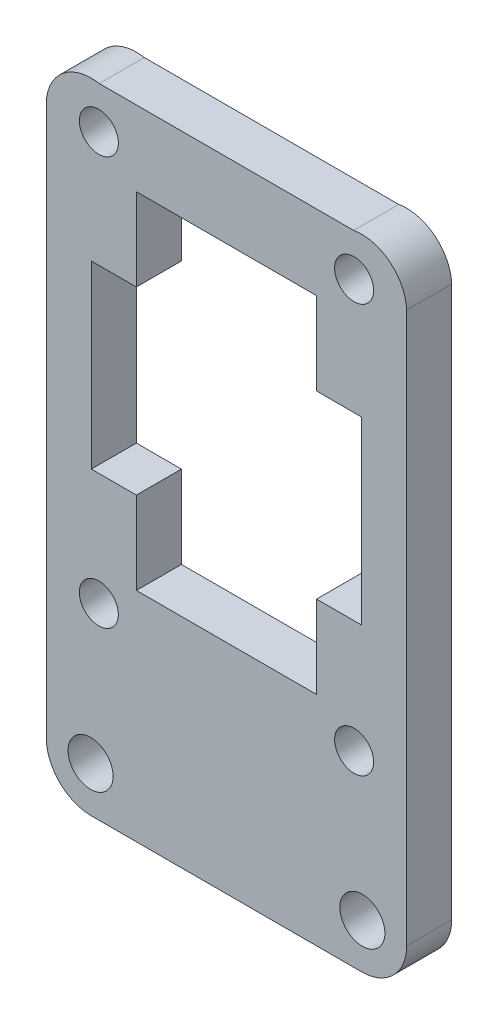
ISO-10303-21;
HEADER;
FILE_DESCRIPTION(('STEP AP214'),'2;1');
FILE_NAME('part.step','',(''),(''),'','','');
FILE_SCHEMA(('AUTOMOTIVE_DESIGN { 1 0 10303 214 1 1 1 1 }'));
ENDSEC;
DATA;
#1=APPLICATION_CONTEXT('core data for automotive mechanical design processes');
#2=APPLICATION_PROTOCOL_DEFINITION('international standard','automotive_design',2000,#1);
#3=PRODUCT_CONTEXT('',#1,'mechanical');
#4=PRODUCT('Part','Part','',(#3));
#5=PRODUCT_RELATED_PRODUCT_CATEGORY('part','',(#4));
#6=PRODUCT_DEFINITION_FORMATION('','',#4);
#7=PRODUCT_DEFINITION_CONTEXT('part definition',#1,'design');
#8=PRODUCT_DEFINITION('design','',#6,#7);
#9=PRODUCT_DEFINITION_SHAPE('','',#8);
#10=(LENGTH_UNIT() NAMED_UNIT(*) SI_UNIT(.MILLI.,.METRE.));
#11=(NAMED_UNIT(*) PLANE_ANGLE_UNIT() SI_UNIT($,.RADIAN.));
#12=(NAMED_UNIT(*) SI_UNIT($,.STERADIAN.) SOLID_ANGLE_UNIT());
#13=UNCERTAINTY_MEASURE_WITH_UNIT(LENGTH_MEASURE(1.E-05),#10,'distance_accuracy_value','');
#14=(GEOMETRIC_REPRESENTATION_CONTEXT(3) GLOBAL_UNCERTAINTY_ASSIGNED_CONTEXT((#13)) GLOBAL_UNIT_ASSIGNED_CONTEXT((#10,
#11,#12)) REPRESENTATION_CONTEXT('',''));
#15=CARTESIAN_POINT('',(0.,0.,0.));
#16=DIRECTION('',(0.,0.,1.));
#17=DIRECTION('',(1.,0.,0.));
#18=AXIS2_PLACEMENT_3D('',#15,#16,#17);
#19=CARTESIAN_POINT('',(72.2662,0.,3.));
#20=DIRECTION('',(-1.,0.,0.));
#21=DIRECTION('',(0.,0.,1.));
#22=AXIS2_PLACEMENT_3D('',#19,#20,#21);
#23=PLANE('',#22);
#24=DIRECTION('',(0.,1.,0.));
#25=VECTOR('',#24,1.);
#26=CARTESIAN_POINT('',(72.2662,0.,0.));
#27=LINE('',#26,#25);
#28=CARTESIAN_POINT('',(72.2662,19.7499999999624,0.));
#29=VERTEX_POINT('',#28);
#30=CARTESIAN_POINT('',(72.2662,56.4210437109096,0.));
#31=VERTEX_POINT('',#30);
#32=EDGE_CURVE('E262',#29,#31,#27,.T.);
#33=ORIENTED_EDGE('',*,*,#32,.T.);
#34=DIRECTION('',(0.,0.,-1.));
#35=VECTOR('',#34,1.);
#36=CARTESIAN_POINT('',(72.2662,56.4210437109096,3.));
#37=LINE('',#36,#35);
#38=CARTESIAN_POINT('',(72.2662,56.4210437109096,3.));
#39=VERTEX_POINT('',#38);
#40=EDGE_CURVE('E11',#39,#31,#37,.T.);
#41=ORIENTED_EDGE('',*,*,#40,.F.);
#42=DIRECTION('',(0.,1.,0.));
#43=VECTOR('',#42,1.);
#44=CARTESIAN_POINT('',(72.2662,0.,3.));
#45=LINE('',#44,#43);
#46=CARTESIAN_POINT('',(72.2662,19.7499999999624,3.));
#47=VERTEX_POINT('',#46);
#48=EDGE_CURVE('E378',#47,#39,#45,.T.);
#49=ORIENTED_EDGE('',*,*,#48,.F.);
#50=DIRECTION('',(0.,0.,-1.));
#51=VECTOR('',#50,1.);
#52=CARTESIAN_POINT('',(72.2662,19.7499999999624,3.));
#53=LINE('',#52,#51);
#54=EDGE_CURVE('E279',#47,#29,#53,.T.);
#55=ORIENTED_EDGE('',*,*,#54,.T.);
#56=EDGE_LOOP('',(#33,#41,#49,#55));
#57=FACE_BOUND('',#56,.T.);
#58=ADVANCED_FACE('F37',(#57),#23,.F.);
#59=CARTESIAN_POINT('',(69.2688575914513,56.2974543063972,3.));
#60=DIRECTION('',(0.,0.,-1.));
#61=DIRECTION('',(-1.,0.,0.));
#62=AXIS2_PLACEMENT_3D('',#59,#60,#61);
#63=CYLINDRICAL_SURFACE('',#62,2.99988930712318);
#64=CARTESIAN_POINT('',(69.2688575914513,56.2974543063972,0.));
#65=DIRECTION('',(0.,0.,1.));
#66=DIRECTION('',(1.,0.,0.));
#67=AXIS2_PLACEMENT_3D('',#64,#65,#66);
#68=CIRCLE('',#67,2.99988930712318);
#69=CARTESIAN_POINT('',(68.7379999999999,59.2499999999624,0.));
#70=VERTEX_POINT('',#69);
#71=EDGE_CURVE('E265',#31,#70,#68,.T.);
#72=ORIENTED_EDGE('',*,*,#71,.T.);
#73=DIRECTION('',(0.,0.,-1.));
#74=VECTOR('',#73,1.);
#75=CARTESIAN_POINT('',(68.7379999999999,59.2499999999624,3.));
#76=LINE('',#75,#74);
#77=CARTESIAN_POINT('',(68.7379999999999,59.2499999999624,3.));
#78=VERTEX_POINT('',#77);
#79=EDGE_CURVE('E47',#78,#70,#76,.T.);
#80=ORIENTED_EDGE('',*,*,#79,.F.);
#81=CARTESIAN_POINT('',(69.2688575914513,56.2974543063972,3.));
#82=DIRECTION('',(0.,0.,1.));
#83=DIRECTION('',(1.,0.,0.));
#84=AXIS2_PLACEMENT_3D('',#81,#82,#83);
#85=CIRCLE('',#84,2.99988930712318);
#86=EDGE_CURVE('E380',#39,#78,#85,.T.);
#87=ORIENTED_EDGE('',*,*,#86,.F.);
#88=ORIENTED_EDGE('',*,*,#40,.T.);
#89=EDGE_LOOP('',(#72,#80,#87,#88));
#90=FACE_BOUND('',#89,.T.);
#91=ADVANCED_FACE('F415',(#90),#63,.T.);
#92=CARTESIAN_POINT('',(0.,59.2499999999624,3.));
#93=DIRECTION('',(0.,1.,0.));
#94=DIRECTION('',(0.,0.,1.));
#95=AXIS2_PLACEMENT_3D('',#92,#93,#94);
#96=PLANE('',#95);
#97=DIRECTION('',(1.,0.,0.));
#98=VECTOR('',#97,1.);
#99=CARTESIAN_POINT('',(0.,59.2499999999624,0.));
#100=LINE('',#99,#98);
#101=CARTESIAN_POINT('',(51.7943,59.2499999999624,0.));
#102=VERTEX_POINT('',#101);
#103=EDGE_CURVE('E268',#102,#70,#100,.T.);
#104=ORIENTED_EDGE('',*,*,#103,.F.);
#105=DIRECTION('',(0.,0.,-1.));
#106=VECTOR('',#105,1.);
#107=CARTESIAN_POINT('',(51.7943,59.2499999999624,3.));
#108=LINE('',#107,#106);
#109=CARTESIAN_POINT('',(51.7943,59.2499999999624,3.));
#110=VERTEX_POINT('',#109);
#111=EDGE_CURVE('E286',#110,#102,#108,.T.);
#112=ORIENTED_EDGE('',*,*,#111,.F.);
#113=DIRECTION('',(1.,0.,0.));
#114=VECTOR('',#113,1.);
#115=CARTESIAN_POINT('',(0.,59.2499999999624,3.));
#116=LINE('',#115,#114);
#117=EDGE_CURVE('E382',#110,#78,#116,.T.);
#118=ORIENTED_EDGE('',*,*,#117,.T.);
#119=ORIENTED_EDGE('',*,*,#79,.T.);
#120=EDGE_LOOP('',(#104,#112,#118,#119));
#121=FACE_BOUND('',#120,.T.);
#122=ADVANCED_FACE('F420',(#121),#96,.T.);
#123=CARTESIAN_POINT('',(51.2640806704155,56.2973396203173,3.));
#124=DIRECTION('',(0.,0.,-1.));
#125=DIRECTION('',(-1.,0.,0.));
#126=AXIS2_PLACEMENT_3D('',#123,#124,#125);
#127=CYLINDRICAL_SURFACE('',#126,2.99988930712304);
#128=CARTESIAN_POINT('',(51.2640806704155,56.2973396203173,0.));
#129=DIRECTION('',(0.,0.,1.));
#130=DIRECTION('',(1.,0.,0.));
#131=AXIS2_PLACEMENT_3D('',#128,#129,#130);
#132=CIRCLE('',#131,2.99988930712304);
#133=CARTESIAN_POINT('',(48.2662,56.4070999999623,0.));
#134=VERTEX_POINT('',#133);
#135=EDGE_CURVE('E271',#102,#134,#132,.T.);
#136=ORIENTED_EDGE('',*,*,#135,.T.);
#137=DIRECTION('',(0.,0.,-1.));
#138=VECTOR('',#137,1.);
#139=CARTESIAN_POINT('',(48.2662,56.4070999999623,3.));
#140=LINE('',#139,#138);
#141=CARTESIAN_POINT('',(48.2662,56.4070999999623,3.));
#142=VERTEX_POINT('',#141);
#143=EDGE_CURVE('E283',#142,#134,#140,.T.);
#144=ORIENTED_EDGE('',*,*,#143,.F.);
#145=CARTESIAN_POINT('',(51.2640806704155,56.2973396203173,3.));
#146=DIRECTION('',(0.,0.,1.));
#147=DIRECTION('',(1.,0.,0.));
#148=AXIS2_PLACEMENT_3D('',#145,#146,#147);
#149=CIRCLE('',#148,2.99988930712304);
#150=EDGE_CURVE('E385',#110,#142,#149,.T.);
#151=ORIENTED_EDGE('',*,*,#150,.F.);
#152=ORIENTED_EDGE('',*,*,#111,.T.);
#153=EDGE_LOOP('',(#136,#144,#151,#152));
#154=FACE_BOUND('',#153,.T.);
#155=ADVANCED_FACE('F390',(#154),#127,.T.);
#156=CARTESIAN_POINT('',(48.2662,0.,3.));
#157=DIRECTION('',(1.,0.,0.));
#158=DIRECTION('',(0.,0.,-1.));
#159=AXIS2_PLACEMENT_3D('',#156,#157,#158);
#160=PLANE('',#159);
#161=DIRECTION('',(0.,-1.,0.));
#162=VECTOR('',#161,1.);
#163=CARTESIAN_POINT('',(48.2662,0.,0.));
#164=LINE('',#163,#162);
#165=CARTESIAN_POINT('',(48.2662,19.7499999999711,0.));
#166=VERTEX_POINT('',#165);
#167=EDGE_CURVE('E273',#134,#166,#164,.T.);
#168=ORIENTED_EDGE('',*,*,#167,.T.);
#169=DIRECTION('',(0.,0.,-1.));
#170=VECTOR('',#169,1.);
#171=CARTESIAN_POINT('',(48.2662,19.7499999999711,3.));
#172=LINE('',#171,#170);
#173=CARTESIAN_POINT('',(48.2662,19.7499999999711,3.));
#174=VERTEX_POINT('',#173);
#175=EDGE_CURVE('E200',#174,#166,#172,.T.);
#176=ORIENTED_EDGE('',*,*,#175,.F.);
#177=DIRECTION('',(0.,-1.,0.));
#178=VECTOR('',#177,1.);
#179=CARTESIAN_POINT('',(48.2662,0.,3.));
#180=LINE('',#179,#178);
#181=EDGE_CURVE('E191',#142,#174,#180,.T.);
#182=ORIENTED_EDGE('',*,*,#181,.F.);
#183=ORIENTED_EDGE('',*,*,#143,.T.);
#184=EDGE_LOOP('',(#168,#176,#182,#183));
#185=FACE_BOUND('',#184,.T.);
#186=ADVANCED_FACE('F394',(#185),#160,.F.);
#187=CARTESIAN_POINT('',(51.2662694511509,19.7500694511131,3.));
#188=DIRECTION('',(0.,0.,-1.));
#189=DIRECTION('',(-1.,0.,0.));
#190=AXIS2_PLACEMENT_3D('',#187,#188,#189);
#191=CYLINDRICAL_SURFACE('',#190,3.00006945195479);
#192=CARTESIAN_POINT('',(51.2662694511509,19.7500694511131,0.));
#193=DIRECTION('',(0.,0.,1.));
#194=DIRECTION('',(1.,0.,0.));
#195=AXIS2_PLACEMENT_3D('',#192,#193,#194);
#196=CIRCLE('',#195,3.00006945195479);
#197=CARTESIAN_POINT('',(51.2662,16.7499999999622,0.));
#198=VERTEX_POINT('',#197);
#199=EDGE_CURVE('E199',#166,#198,#196,.T.);
#200=ORIENTED_EDGE('',*,*,#199,.T.);
#201=DIRECTION('',(0.,0.,-1.));
#202=VECTOR('',#201,1.);
#203=CARTESIAN_POINT('',(51.2662,16.7499999999622,3.));
#204=LINE('',#203,#202);
#205=CARTESIAN_POINT('',(51.2662,16.7499999999622,3.));
#206=VERTEX_POINT('',#205);
#207=EDGE_CURVE('E196',#206,#198,#204,.T.);
#208=ORIENTED_EDGE('',*,*,#207,.F.);
#209=CARTESIAN_POINT('',(51.2662694511509,19.7500694511131,3.));
#210=DIRECTION('',(0.,0.,1.));
#211=DIRECTION('',(1.,0.,0.));
#212=AXIS2_PLACEMENT_3D('',#209,#210,#211);
#213=CIRCLE('',#212,3.00006945195479);
#214=EDGE_CURVE('E185',#174,#206,#213,.T.);
#215=ORIENTED_EDGE('',*,*,#214,.F.);
#216=ORIENTED_EDGE('',*,*,#175,.T.);
#217=EDGE_LOOP('',(#200,#208,#215,#216));
#218=FACE_BOUND('',#217,.T.);
#219=ADVANCED_FACE('F197',(#218),#191,.T.);
#220=CARTESIAN_POINT('',(0.,16.749999999962,3.));
#221=DIRECTION('',(0.,1.,0.));
#222=DIRECTION('',(-1.,0.,0.));
#223=AXIS2_PLACEMENT_3D('',#220,#221,#222);
#224=PLANE('',#223);
#225=DIRECTION('',(1.,0.,0.));
#226=VECTOR('',#225,1.);
#227=CARTESIAN_POINT('',(0.,16.749999999962,0.));
#228=LINE('',#227,#226);
#229=CARTESIAN_POINT('',(69.2662,16.7499999999623,0.));
#230=VERTEX_POINT('',#229);
#231=EDGE_CURVE('E121',#198,#230,#228,.T.);
#232=ORIENTED_EDGE('',*,*,#231,.T.);
#233=DIRECTION('',(0.,0.,-1.));
#234=VECTOR('',#233,1.);
#235=CARTESIAN_POINT('',(69.2662,16.7499999999623,3.));
#236=LINE('',#235,#234);
#237=CARTESIAN_POINT('',(69.2662,16.7499999999623,3.));
#238=VERTEX_POINT('',#237);
#239=EDGE_CURVE('E201',#238,#230,#236,.T.);
#240=ORIENTED_EDGE('',*,*,#239,.F.);
#241=DIRECTION('',(1.,0.,0.));
#242=VECTOR('',#241,1.);
#243=CARTESIAN_POINT('',(0.,16.749999999962,3.));
#244=LINE('',#243,#242);
#245=EDGE_CURVE('E189',#206,#238,#244,.T.);
#246=ORIENTED_EDGE('',*,*,#245,.F.);
#247=ORIENTED_EDGE('',*,*,#207,.T.);
#248=EDGE_LOOP('',(#232,#240,#246,#247));
#249=FACE_BOUND('',#248,.T.);
#250=ADVANCED_FACE('F203',(#249),#224,.F.);
#251=CARTESIAN_POINT('',(66.2661999999974,-1.33764110898929E-12,3.));
#252=DIRECTION('',(-1.,0.,0.));
#253=DIRECTION('',(0.,-1.,0.));
#254=AXIS2_PLACEMENT_3D('',#251,#252,#253);
#255=PLANE('',#254);
#256=DIRECTION('',(0.,1.,0.));
#257=VECTOR('',#256,1.);
#258=CARTESIAN_POINT('',(66.2661999999974,-1.33764110898929E-12,0.));
#259=LINE('',#258,#257);
#260=CARTESIAN_POINT('',(66.2661999999984,48.7499999999623,0.));
#261=VERTEX_POINT('',#260);
#262=CARTESIAN_POINT('',(66.2661999999985,54.2499999999624,0.));
#263=VERTEX_POINT('',#262);
#264=EDGE_CURVE('E209',#261,#263,#259,.T.);
#265=ORIENTED_EDGE('',*,*,#264,.F.);
#266=DIRECTION('',(0.,0.,-1.));
#267=VECTOR('',#266,1.);
#268=CARTESIAN_POINT('',(66.2661999999984,48.7499999999623,3.));
#269=LINE('',#268,#267);
#270=CARTESIAN_POINT('',(66.2661999999984,48.7499999999623,3.));
#271=VERTEX_POINT('',#270);
#272=EDGE_CURVE('E41',#271,#261,#269,.T.);
#273=ORIENTED_EDGE('',*,*,#272,.F.);
#274=DIRECTION('',(0.,1.,0.));
#275=VECTOR('',#274,1.);
#276=CARTESIAN_POINT('',(66.2661999999974,-1.33764110898929E-12,3.));
#277=LINE('',#276,#275);
#278=CARTESIAN_POINT('',(66.2661999999985,54.2499999999624,3.));
#279=VERTEX_POINT('',#278);
#280=EDGE_CURVE('E278',#271,#279,#277,.T.);
#281=ORIENTED_EDGE('',*,*,#280,.T.);
#282=DIRECTION('',(0.,0.,-1.));
#283=VECTOR('',#282,1.);
#284=CARTESIAN_POINT('',(66.2661999999985,54.2499999999624,3.));
#285=LINE('',#284,#283);
#286=EDGE_CURVE('E205',#279,#263,#285,.T.);
#287=ORIENTED_EDGE('',*,*,#286,.T.);
#288=EDGE_LOOP('',(#265,#273,#281,#287));
#289=FACE_BOUND('',#288,.T.);
#290=ADVANCED_FACE('F39',(#289),#255,.T.);
#291=CARTESIAN_POINT('',(0.,48.7499999999623,3.));
#292=DIRECTION('',(0.,-1.,0.));
#293=DIRECTION('',(0.,0.,-1.));
#294=AXIS2_PLACEMENT_3D('',#291,#292,#293);
#295=PLANE('',#294);
#296=DIRECTION('',(-1.,0.,0.));
#297=VECTOR('',#296,1.);
#298=CARTESIAN_POINT('',(0.,48.7499999999623,0.));
#299=LINE('',#298,#297);
#300=CARTESIAN_POINT('',(69.2662,48.7499999999623,0.));
#301=VERTEX_POINT('',#300);
#302=EDGE_CURVE('E212',#301,#261,#299,.T.);
#303=ORIENTED_EDGE('',*,*,#302,.F.);
#304=DIRECTION('',(0.,0.,-1.));
#305=VECTOR('',#304,1.);
#306=CARTESIAN_POINT('',(69.2662,48.7499999999623,3.));
#307=LINE('',#306,#305);
#308=CARTESIAN_POINT('',(69.2662,48.7499999999623,3.));
#309=VERTEX_POINT('',#308);
#310=EDGE_CURVE('E308',#309,#301,#307,.T.);
#311=ORIENTED_EDGE('',*,*,#310,.F.);
#312=DIRECTION('',(-1.,0.,0.));
#313=VECTOR('',#312,1.);
#314=CARTESIAN_POINT('',(0.,48.7499999999623,3.));
#315=LINE('',#314,#313);
#316=EDGE_CURVE('E317',#309,#271,#315,.T.);
#317=ORIENTED_EDGE('',*,*,#316,.T.);
#318=ORIENTED_EDGE('',*,*,#272,.T.);
#319=EDGE_LOOP('',(#303,#311,#317,#318));
#320=FACE_BOUND('',#319,.T.);
#321=ADVANCED_FACE('F315',(#320),#295,.T.);
#322=CARTESIAN_POINT('',(69.2662,0.,3.));
#323=DIRECTION('',(1.,0.,0.));
#324=DIRECTION('',(0.,0.,-1.));
#325=AXIS2_PLACEMENT_3D('',#322,#323,#324);
#326=PLANE('',#325);
#327=DIRECTION('',(0.,-1.,0.));
#328=VECTOR('',#327,1.);
#329=CARTESIAN_POINT('',(69.2662,0.,0.));
#330=LINE('',#329,#328);
#331=CARTESIAN_POINT('',(69.2662,36.7499999999623,0.));
#332=VERTEX_POINT('',#331);
#333=EDGE_CURVE('E215',#301,#332,#330,.T.);
#334=ORIENTED_EDGE('',*,*,#333,.T.);
#335=DIRECTION('',(0.,0.,-1.));
#336=VECTOR('',#335,1.);
#337=CARTESIAN_POINT('',(69.2662,36.7499999999623,3.));
#338=LINE('',#337,#336);
#339=CARTESIAN_POINT('',(69.2662,36.7499999999623,3.));
#340=VERTEX_POINT('',#339);
#341=EDGE_CURVE('E306',#340,#332,#338,.T.);
#342=ORIENTED_EDGE('',*,*,#341,.F.);
#343=DIRECTION('',(0.,-1.,0.));
#344=VECTOR('',#343,1.);
#345=CARTESIAN_POINT('',(69.2662,0.,3.));
#346=LINE('',#345,#344);
#347=EDGE_CURVE('E335',#309,#340,#346,.T.);
#348=ORIENTED_EDGE('',*,*,#347,.F.);
#349=ORIENTED_EDGE('',*,*,#310,.T.);
#350=EDGE_LOOP('',(#334,#342,#348,#349));
#351=FACE_BOUND('',#350,.T.);
#352=ADVANCED_FACE('F325',(#351),#326,.F.);
#353=CARTESIAN_POINT('',(0.,36.7499999999623,3.));
#354=DIRECTION('',(0.,-1.,0.));
#355=DIRECTION('',(0.,0.,-1.));
#356=AXIS2_PLACEMENT_3D('',#353,#354,#355);
#357=PLANE('',#356);
#358=DIRECTION('',(-1.,0.,0.));
#359=VECTOR('',#358,1.);
#360=CARTESIAN_POINT('',(0.,36.7499999999623,0.));
#361=LINE('',#360,#359);
#362=CARTESIAN_POINT('',(66.2662,36.7499999999623,0.));
#363=VERTEX_POINT('',#362);
#364=EDGE_CURVE('E217',#332,#363,#361,.T.);
#365=ORIENTED_EDGE('',*,*,#364,.T.);
#366=DIRECTION('',(0.,0.,-1.));
#367=VECTOR('',#366,1.);
#368=CARTESIAN_POINT('',(66.2662,36.7499999999623,3.));
#369=LINE('',#368,#367);
#370=CARTESIAN_POINT('',(66.2662,36.7499999999623,3.));
#371=VERTEX_POINT('',#370);
#372=EDGE_CURVE('E304',#371,#363,#369,.T.);
#373=ORIENTED_EDGE('',*,*,#372,.F.);
#374=DIRECTION('',(-1.,0.,0.));
#375=VECTOR('',#374,1.);
#376=CARTESIAN_POINT('',(0.,36.7499999999623,3.));
#377=LINE('',#376,#375);
#378=EDGE_CURVE('E330',#340,#371,#377,.T.);
#379=ORIENTED_EDGE('',*,*,#378,.F.);
#380=ORIENTED_EDGE('',*,*,#341,.T.);
#381=EDGE_LOOP('',(#365,#373,#379,#380));
#382=FACE_BOUND('',#381,.T.);
#383=ADVANCED_FACE('F328',(#382),#357,.F.);
#384=CARTESIAN_POINT('',(66.2662,0.,3.));
#385=DIRECTION('',(-1.,0.,0.));
#386=DIRECTION('',(0.,0.,1.));
#387=AXIS2_PLACEMENT_3D('',#384,#385,#386);
#388=PLANE('',#387);
#389=DIRECTION('',(0.,1.,0.));
#390=VECTOR('',#389,1.);
#391=CARTESIAN_POINT('',(66.2662,0.,0.));
#392=LINE('',#391,#390);
#393=CARTESIAN_POINT('',(66.2662,31.2499999999623,0.));
#394=VERTEX_POINT('',#393);
#395=EDGE_CURVE('E220',#394,#363,#392,.T.);
#396=ORIENTED_EDGE('',*,*,#395,.F.);
#397=DIRECTION('',(0.,0.,-1.));
#398=VECTOR('',#397,1.);
#399=CARTESIAN_POINT('',(66.2662,31.2499999999623,3.));
#400=LINE('',#399,#398);
#401=CARTESIAN_POINT('',(66.2662,31.2499999999623,3.));
#402=VERTEX_POINT('',#401);
#403=EDGE_CURVE('E302',#402,#394,#400,.T.);
#404=ORIENTED_EDGE('',*,*,#403,.F.);
#405=DIRECTION('',(0.,1.,0.));
#406=VECTOR('',#405,1.);
#407=CARTESIAN_POINT('',(66.2662,0.,3.));
#408=LINE('',#407,#406);
#409=EDGE_CURVE('E334',#402,#371,#408,.T.);
#410=ORIENTED_EDGE('',*,*,#409,.T.);
#411=ORIENTED_EDGE('',*,*,#372,.T.);
#412=EDGE_LOOP('',(#396,#404,#410,#411));
#413=FACE_BOUND('',#412,.T.);
#414=ADVANCED_FACE('F471',(#413),#388,.T.);
#415=CARTESIAN_POINT('',(0.,31.2499999999623,3.));
#416=DIRECTION('',(0.,-1.,0.));
#417=DIRECTION('',(0.,0.,-1.));
#418=AXIS2_PLACEMENT_3D('',#415,#416,#417);
#419=PLANE('',#418);
#420=DIRECTION('',(-1.,0.,0.));
#421=VECTOR('',#420,1.);
#422=CARTESIAN_POINT('',(0.,31.2499999999623,0.));
#423=LINE('',#422,#421);
#424=CARTESIAN_POINT('',(54.2662,31.2499999999623,0.));
#425=VERTEX_POINT('',#424);
#426=EDGE_CURVE('E223',#394,#425,#423,.T.);
#427=ORIENTED_EDGE('',*,*,#426,.T.);
#428=DIRECTION('',(0.,0.,-1.));
#429=VECTOR('',#428,1.);
#430=CARTESIAN_POINT('',(54.2662,31.2499999999623,3.));
#431=LINE('',#430,#429);
#432=CARTESIAN_POINT('',(54.2662,31.2499999999623,3.));
#433=VERTEX_POINT('',#432);
#434=EDGE_CURVE('E300',#433,#425,#431,.T.);
#435=ORIENTED_EDGE('',*,*,#434,.F.);
#436=DIRECTION('',(-1.,0.,0.));
#437=VECTOR('',#436,1.);
#438=CARTESIAN_POINT('',(0.,31.2499999999623,3.));
#439=LINE('',#438,#437);
#440=EDGE_CURVE('E337',#402,#433,#439,.T.);
#441=ORIENTED_EDGE('',*,*,#440,.F.);
#442=ORIENTED_EDGE('',*,*,#403,.T.);
#443=EDGE_LOOP('',(#427,#435,#441,#442));
#444=FACE_BOUND('',#443,.T.);
#445=ADVANCED_FACE('F467',(#444),#419,.F.);
#446=CARTESIAN_POINT('',(54.2662,0.,3.));
#447=DIRECTION('',(1.,0.,0.));
#448=DIRECTION('',(0.,0.,-1.));
#449=AXIS2_PLACEMENT_3D('',#446,#447,#448);
#450=PLANE('',#449);
#451=DIRECTION('',(0.,-1.,0.));
#452=VECTOR('',#451,1.);
#453=CARTESIAN_POINT('',(54.2662,0.,0.));
#454=LINE('',#453,#452);
#455=CARTESIAN_POINT('',(54.2662,36.7499999999623,0.));
#456=VERTEX_POINT('',#455);
#457=EDGE_CURVE('E226',#456,#425,#454,.T.);
#458=ORIENTED_EDGE('',*,*,#457,.F.);
#459=DIRECTION('',(0.,0.,-1.));
#460=VECTOR('',#459,1.);
#461=CARTESIAN_POINT('',(54.2662,36.7499999999623,3.));
#462=LINE('',#461,#460);
#463=CARTESIAN_POINT('',(54.2662,36.7499999999623,3.));
#464=VERTEX_POINT('',#463);
#465=EDGE_CURVE('E298',#464,#456,#462,.T.);
#466=ORIENTED_EDGE('',*,*,#465,.F.);
#467=DIRECTION('',(0.,-1.,0.));
#468=VECTOR('',#467,1.);
#469=CARTESIAN_POINT('',(54.2662,0.,3.));
#470=LINE('',#469,#468);
#471=EDGE_CURVE('E343',#464,#433,#470,.T.);
#472=ORIENTED_EDGE('',*,*,#471,.T.);
#473=ORIENTED_EDGE('',*,*,#434,.T.);
#474=EDGE_LOOP('',(#458,#466,#472,#473));
#475=FACE_BOUND('',#474,.T.);
#476=ADVANCED_FACE('F463',(#475),#450,.T.);
#477=CARTESIAN_POINT('',(0.,36.7499999999623,3.));
#478=DIRECTION('',(0.,1.,0.));
#479=DIRECTION('',(0.,0.,1.));
#480=AXIS2_PLACEMENT_3D('',#477,#478,#479);
#481=PLANE('',#480);
#482=DIRECTION('',(1.,0.,0.));
#483=VECTOR('',#482,1.);
#484=CARTESIAN_POINT('',(0.,36.7499999999623,0.));
#485=LINE('',#484,#483);
#486=CARTESIAN_POINT('',(51.2662,36.7499999999623,0.));
#487=VERTEX_POINT('',#486);
#488=EDGE_CURVE('E229',#487,#456,#485,.T.);
#489=ORIENTED_EDGE('',*,*,#488,.F.);
#490=DIRECTION('',(0.,0.,-1.));
#491=VECTOR('',#490,1.);
#492=CARTESIAN_POINT('',(51.2662,36.7499999999623,3.));
#493=LINE('',#492,#491);
#494=CARTESIAN_POINT('',(51.2662,36.7499999999623,3.));
#495=VERTEX_POINT('',#494);
#496=EDGE_CURVE('E296',#495,#487,#493,.T.);
#497=ORIENTED_EDGE('',*,*,#496,.F.);
#498=DIRECTION('',(1.,0.,0.));
#499=VECTOR('',#498,1.);
#500=CARTESIAN_POINT('',(0.,36.7499999999623,3.));
#501=LINE('',#500,#499);
#502=EDGE_CURVE('E346',#495,#464,#501,.T.);
#503=ORIENTED_EDGE('',*,*,#502,.T.);
#504=ORIENTED_EDGE('',*,*,#465,.T.);
#505=EDGE_LOOP('',(#489,#497,#503,#504));
#506=FACE_BOUND('',#505,.T.);
#507=ADVANCED_FACE('F459',(#506),#481,.T.);
#508=CARTESIAN_POINT('',(51.2661999999996,-4.74307630208648E-13,3.));
#509=DIRECTION('',(1.,0.,0.));
#510=DIRECTION('',(0.,1.,0.));
#511=AXIS2_PLACEMENT_3D('',#508,#509,#510);
#512=PLANE('',#511);
#513=DIRECTION('',(0.,-1.,0.));
#514=VECTOR('',#513,1.);
#515=CARTESIAN_POINT('',(51.2661999999996,-4.74307630208648E-13,0.));
#516=LINE('',#515,#514);
#517=CARTESIAN_POINT('',(51.2662000000001,48.7499999999623,0.));
#518=VERTEX_POINT('',#517);
#519=EDGE_CURVE('E232',#518,#487,#516,.T.);
#520=ORIENTED_EDGE('',*,*,#519,.F.);
#521=DIRECTION('',(0.,0.,-1.));
#522=VECTOR('',#521,1.);
#523=CARTESIAN_POINT('',(51.2662000000001,48.7499999999623,3.));
#524=LINE('',#523,#522);
#525=CARTESIAN_POINT('',(51.2662000000001,48.7499999999623,3.));
#526=VERTEX_POINT('',#525);
#527=EDGE_CURVE('E294',#526,#518,#524,.T.);
#528=ORIENTED_EDGE('',*,*,#527,.F.);
#529=DIRECTION('',(0.,-1.,0.));
#530=VECTOR('',#529,1.);
#531=CARTESIAN_POINT('',(51.2661999999996,-4.74307630208648E-13,3.));
#532=LINE('',#531,#530);
#533=EDGE_CURVE('E349',#526,#495,#532,.T.);
#534=ORIENTED_EDGE('',*,*,#533,.T.);
#535=ORIENTED_EDGE('',*,*,#496,.T.);
#536=EDGE_LOOP('',(#520,#528,#534,#535));
#537=FACE_BOUND('',#536,.T.);
#538=ADVANCED_FACE('F455',(#537),#512,.T.);
#539=CARTESIAN_POINT('',(0.,48.7499999999623,3.));
#540=DIRECTION('',(0.,-1.,0.));
#541=DIRECTION('',(0.,0.,-1.));
#542=AXIS2_PLACEMENT_3D('',#539,#540,#541);
#543=PLANE('',#542);
#544=DIRECTION('',(-1.,0.,0.));
#545=VECTOR('',#544,1.);
#546=CARTESIAN_POINT('',(0.,48.7499999999623,0.));
#547=LINE('',#546,#545);
#548=CARTESIAN_POINT('',(54.2661999999984,48.7499999999623,0.));
#549=VERTEX_POINT('',#548);
#550=EDGE_CURVE('E235',#549,#518,#547,.T.);
#551=ORIENTED_EDGE('',*,*,#550,.F.);
#552=DIRECTION('',(0.,0.,-1.));
#553=VECTOR('',#552,1.);
#554=CARTESIAN_POINT('',(54.2661999999984,48.7499999999623,3.));
#555=LINE('',#554,#553);
#556=CARTESIAN_POINT('',(54.2661999999984,48.7499999999623,3.));
#557=VERTEX_POINT('',#556);
#558=EDGE_CURVE('E292',#557,#549,#555,.T.);
#559=ORIENTED_EDGE('',*,*,#558,.F.);
#560=DIRECTION('',(-1.,0.,0.));
#561=VECTOR('',#560,1.);
#562=CARTESIAN_POINT('',(0.,48.7499999999623,3.));
#563=LINE('',#562,#561);
#564=EDGE_CURVE('E352',#557,#526,#563,.T.);
#565=ORIENTED_EDGE('',*,*,#564,.T.);
#566=ORIENTED_EDGE('',*,*,#527,.T.);
#567=EDGE_LOOP('',(#551,#559,#565,#566));
#568=FACE_BOUND('',#567,.T.);
#569=ADVANCED_FACE('F451',(#568),#543,.T.);
#570=CARTESIAN_POINT('',(54.2661999999984,0.,3.));
#571=DIRECTION('',(1.,0.,0.));
#572=DIRECTION('',(0.,0.,-1.));
#573=AXIS2_PLACEMENT_3D('',#570,#571,#572);
#574=PLANE('',#573);
#575=DIRECTION('',(0.,-1.,0.));
#576=VECTOR('',#575,1.);
#577=CARTESIAN_POINT('',(54.2661999999984,0.,0.));
#578=LINE('',#577,#576);
#579=CARTESIAN_POINT('',(54.2661999999984,54.2499999999624,0.));
#580=VERTEX_POINT('',#579);
#581=EDGE_CURVE('E238',#580,#549,#578,.T.);
#582=ORIENTED_EDGE('',*,*,#581,.F.);
#583=DIRECTION('',(0.,0.,-1.));
#584=VECTOR('',#583,1.);
#585=CARTESIAN_POINT('',(54.2661999999984,54.2499999999624,3.));
#586=LINE('',#585,#584);
#587=CARTESIAN_POINT('',(54.2661999999984,54.2499999999624,3.));
#588=VERTEX_POINT('',#587);
#589=EDGE_CURVE('E290',#588,#580,#586,.T.);
#590=ORIENTED_EDGE('',*,*,#589,.F.);
#591=DIRECTION('',(0.,-1.,0.));
#592=VECTOR('',#591,1.);
#593=CARTESIAN_POINT('',(54.2661999999984,0.,3.));
#594=LINE('',#593,#592);
#595=EDGE_CURVE('E355',#588,#557,#594,.T.);
#596=ORIENTED_EDGE('',*,*,#595,.T.);
#597=ORIENTED_EDGE('',*,*,#558,.T.);
#598=EDGE_LOOP('',(#582,#590,#596,#597));
#599=FACE_BOUND('',#598,.T.);
#600=ADVANCED_FACE('F429',(#599),#574,.T.);
#601=CARTESIAN_POINT('',(69.3162499966666,19.750049996629,3.));
#602=DIRECTION('',(0.,0.,-1.));
#603=DIRECTION('',(-1.,0.,0.));
#604=AXIS2_PLACEMENT_3D('',#601,#602,#603);
#605=CYLINDRICAL_SURFACE('',#604,1.49995000416656);
#606=CARTESIAN_POINT('',(69.3162499966666,19.750049996629,3.));
#607=DIRECTION('',(0.,0.,1.));
#608=DIRECTION('',(1.,0.,0.));
#609=AXIS2_PLACEMENT_3D('',#606,#607,#608);
#610=CIRCLE('',#609,1.49995000416656);
#611=CARTESIAN_POINT('',(70.8162000008331,19.750049996629,3.));
#612=VERTEX_POINT('',#611);
#613=EDGE_CURVE('E375',#612,#612,#610,.T.);
#614=ORIENTED_EDGE('',*,*,#613,.T.);
#615=EDGE_LOOP('',(#614));
#616=FACE_BOUND('',#615,.T.);
#617=CARTESIAN_POINT('',(69.3162499966666,19.750049996629,0.));
#618=DIRECTION('',(0.,0.,1.));
#619=DIRECTION('',(1.,0.,0.));
#620=AXIS2_PLACEMENT_3D('',#617,#618,#619);
#621=CIRCLE('',#620,1.49995000416656);
#622=CARTESIAN_POINT('',(70.8162000008331,19.750049996629,0.));
#623=VERTEX_POINT('',#622);
#624=EDGE_CURVE('E259',#623,#623,#621,.T.);
#625=ORIENTED_EDGE('',*,*,#624,.F.);
#626=EDGE_LOOP('',(#625));
#627=FACE_BOUND('',#626,.T.);
#628=ADVANCED_FACE('F425',(#616,#627),#605,.F.);
#629=CARTESIAN_POINT('',(51.2162499966666,19.750049996629,3.));
#630=DIRECTION('',(0.,0.,-1.));
#631=DIRECTION('',(-1.,0.,0.));
#632=AXIS2_PLACEMENT_3D('',#629,#630,#631);
#633=CYLINDRICAL_SURFACE('',#632,1.49995000416655);
#634=CARTESIAN_POINT('',(51.2162499966666,19.750049996629,3.));
#635=DIRECTION('',(0.,0.,1.));
#636=DIRECTION('',(1.,0.,0.));
#637=AXIS2_PLACEMENT_3D('',#634,#635,#636);
#638=CIRCLE('',#637,1.49995000416655);
#639=CARTESIAN_POINT('',(52.7162000008331,19.750049996629,3.));
#640=VERTEX_POINT('',#639);
#641=EDGE_CURVE('E372',#640,#640,#638,.T.);
#642=ORIENTED_EDGE('',*,*,#641,.T.);
#643=EDGE_LOOP('',(#642));
#644=FACE_BOUND('',#643,.T.);
#645=CARTESIAN_POINT('',(51.2162499966666,19.750049996629,0.));
#646=DIRECTION('',(0.,0.,1.));
#647=DIRECTION('',(1.,0.,0.));
#648=AXIS2_PLACEMENT_3D('',#645,#646,#647);
#649=CIRCLE('',#648,1.49995000416655);
#650=CARTESIAN_POINT('',(52.7162000008331,19.750049996629,0.));
#651=VERTEX_POINT('',#650);
#652=EDGE_CURVE('E256',#651,#651,#649,.T.);
#653=ORIENTED_EDGE('',*,*,#652,.F.);
#654=EDGE_LOOP('',(#653));
#655=FACE_BOUND('',#654,.T.);
#656=ADVANCED_FACE('F428',(#644,#655),#633,.F.);
#657=CARTESIAN_POINT('',(68.76615,29.2500499999623,3.));
#658=DIRECTION('',(0.,0.,-1.));
#659=DIRECTION('',(-1.,0.,0.));
#660=AXIS2_PLACEMENT_3D('',#657,#658,#659);
#661=CYLINDRICAL_SURFACE('',#660,1.29895000096232);
#662=CARTESIAN_POINT('',(68.76615,29.2500499999623,3.));
#663=DIRECTION('',(0.,0.,1.));
#664=DIRECTION('',(1.,0.,0.));
#665=AXIS2_PLACEMENT_3D('',#662,#663,#664);
#666=CIRCLE('',#665,1.29895000096232);
#667=CARTESIAN_POINT('',(70.0651000009623,29.2500499999623,3.));
#668=VERTEX_POINT('',#667);
#669=EDGE_CURVE('E369',#668,#668,#666,.T.);
#670=ORIENTED_EDGE('',*,*,#669,.T.);
#671=EDGE_LOOP('',(#670));
#672=FACE_BOUND('',#671,.T.);
#673=CARTESIAN_POINT('',(68.76615,29.2500499999623,0.));
#674=DIRECTION('',(0.,0.,1.));
#675=DIRECTION('',(1.,0.,0.));
#676=AXIS2_PLACEMENT_3D('',#673,#674,#675);
#677=CIRCLE('',#676,1.29895000096232);
#678=CARTESIAN_POINT('',(70.0651000009623,29.2500499999623,0.));
#679=VERTEX_POINT('',#678);
#680=EDGE_CURVE('E253',#679,#679,#677,.T.);
#681=ORIENTED_EDGE('',*,*,#680,.F.);
#682=EDGE_LOOP('',(#681));
#683=FACE_BOUND('',#682,.T.);
#684=ADVANCED_FACE('F433',(#672,#683),#661,.F.);
#685=CARTESIAN_POINT('',(51.76615,29.2500499999623,3.));
#686=DIRECTION('',(0.,0.,-1.));
#687=DIRECTION('',(-1.,0.,0.));
#688=AXIS2_PLACEMENT_3D('',#685,#686,#687);
#689=CYLINDRICAL_SURFACE('',#688,1.29895000096231);
#690=CARTESIAN_POINT('',(51.76615,29.2500499999623,3.));
#691=DIRECTION('',(0.,0.,1.));
#692=DIRECTION('',(1.,0.,0.));
#693=AXIS2_PLACEMENT_3D('',#690,#691,#692);
#694=CIRCLE('',#693,1.29895000096231);
#695=CARTESIAN_POINT('',(53.0651000009623,29.2500499999623,3.));
#696=VERTEX_POINT('',#695);
#697=EDGE_CURVE('E366',#696,#696,#694,.T.);
#698=ORIENTED_EDGE('',*,*,#697,.T.);
#699=EDGE_LOOP('',(#698));
#700=FACE_BOUND('',#699,.T.);
#701=CARTESIAN_POINT('',(51.76615,29.2500499999623,0.));
#702=DIRECTION('',(0.,0.,1.));
#703=DIRECTION('',(1.,0.,0.));
#704=AXIS2_PLACEMENT_3D('',#701,#702,#703);
#705=CIRCLE('',#704,1.29895000096231);
#706=CARTESIAN_POINT('',(53.0651000009623,29.2500499999623,0.));
#707=VERTEX_POINT('',#706);
#708=EDGE_CURVE('E250',#707,#707,#705,.T.);
#709=ORIENTED_EDGE('',*,*,#708,.F.);
#710=EDGE_LOOP('',(#709));
#711=FACE_BOUND('',#710,.T.);
#712=ADVANCED_FACE('F437',(#700,#711),#689,.F.);
#713=CARTESIAN_POINT('',(68.7661500000001,56.4500499999623,3.));
#714=DIRECTION('',(0.,0.,-1.));
#715=DIRECTION('',(-1.,0.,0.));
#716=AXIS2_PLACEMENT_3D('',#713,#714,#715);
#717=CYLINDRICAL_SURFACE('',#716,1.29895000096231);
#718=CARTESIAN_POINT('',(68.7661500000001,56.4500499999623,3.));
#719=DIRECTION('',(0.,0.,1.));
#720=DIRECTION('',(1.,0.,0.));
#721=AXIS2_PLACEMENT_3D('',#718,#719,#720);
#722=CIRCLE('',#721,1.29895000096231);
#723=CARTESIAN_POINT('',(70.0651000009624,56.4500499999623,3.));
#724=VERTEX_POINT('',#723);
#725=EDGE_CURVE('E363',#724,#724,#722,.T.);
#726=ORIENTED_EDGE('',*,*,#725,.T.);
#727=EDGE_LOOP('',(#726));
#728=FACE_BOUND('',#727,.T.);
#729=CARTESIAN_POINT('',(68.7661500000001,56.4500499999623,0.));
#730=DIRECTION('',(0.,0.,1.));
#731=DIRECTION('',(1.,0.,0.));
#732=AXIS2_PLACEMENT_3D('',#729,#730,#731);
#733=CIRCLE('',#732,1.29895000096231);
#734=CARTESIAN_POINT('',(70.0651000009624,56.4500499999623,0.));
#735=VERTEX_POINT('',#734);
#736=EDGE_CURVE('E247',#735,#735,#733,.T.);
#737=ORIENTED_EDGE('',*,*,#736,.F.);
#738=EDGE_LOOP('',(#737));
#739=FACE_BOUND('',#738,.T.);
#740=ADVANCED_FACE('F441',(#728,#739),#717,.F.);
#741=CARTESIAN_POINT('',(51.76615,56.4500499999623,3.));
#742=DIRECTION('',(0.,0.,-1.));
#743=DIRECTION('',(-1.,0.,0.));
#744=AXIS2_PLACEMENT_3D('',#741,#742,#743);
#745=CYLINDRICAL_SURFACE('',#744,1.29895000096231);
#746=CARTESIAN_POINT('',(51.76615,56.4500499999623,3.));
#747=DIRECTION('',(0.,0.,1.));
#748=DIRECTION('',(1.,0.,0.));
#749=AXIS2_PLACEMENT_3D('',#746,#747,#748);
#750=CIRCLE('',#749,1.29895000096231);
#751=CARTESIAN_POINT('',(53.0651000009623,56.4500499999623,3.));
#752=VERTEX_POINT('',#751);
#753=EDGE_CURVE('E360',#752,#752,#750,.T.);
#754=ORIENTED_EDGE('',*,*,#753,.T.);
#755=EDGE_LOOP('',(#754));
#756=FACE_BOUND('',#755,.T.);
#757=CARTESIAN_POINT('',(51.76615,56.4500499999623,0.));
#758=DIRECTION('',(0.,0.,1.));
#759=DIRECTION('',(1.,0.,0.));
#760=AXIS2_PLACEMENT_3D('',#757,#758,#759);
#761=CIRCLE('',#760,1.29895000096231);
#762=CARTESIAN_POINT('',(53.0651000009623,56.4500499999623,0.));
#763=VERTEX_POINT('',#762);
#764=EDGE_CURVE('E244',#763,#763,#761,.T.);
#765=ORIENTED_EDGE('',*,*,#764,.F.);
#766=EDGE_LOOP('',(#765));
#767=FACE_BOUND('',#766,.T.);
#768=ADVANCED_FACE('F409',(#756,#767),#745,.F.);
#769=CARTESIAN_POINT('',(0.,54.2499999999624,3.));
#770=DIRECTION('',(0.,1.,0.));
#771=DIRECTION('',(0.,0.,1.));
#772=AXIS2_PLACEMENT_3D('',#769,#770,#771);
#773=PLANE('',#772);
#774=DIRECTION('',(1.,0.,0.));
#775=VECTOR('',#774,1.);
#776=CARTESIAN_POINT('',(0.,54.2499999999624,0.));
#777=LINE('',#776,#775);
#778=EDGE_CURVE('E241',#580,#263,#777,.T.);
#779=ORIENTED_EDGE('',*,*,#778,.T.);
#780=ORIENTED_EDGE('',*,*,#286,.F.);
#781=DIRECTION('',(1.,0.,0.));
#782=VECTOR('',#781,1.);
#783=CARTESIAN_POINT('',(0.,54.2499999999624,3.));
#784=LINE('',#783,#782);
#785=EDGE_CURVE('E358',#588,#279,#784,.T.);
#786=ORIENTED_EDGE('',*,*,#785,.F.);
#787=ORIENTED_EDGE('',*,*,#589,.T.);
#788=EDGE_LOOP('',(#779,#780,#786,#787));
#789=FACE_BOUND('',#788,.T.);
#790=ADVANCED_FACE('F402',(#789),#773,.F.);
#791=CARTESIAN_POINT('',(69.2659598108652,19.7502401890972,3.));
#792=DIRECTION('',(0.,0.,-1.));
#793=DIRECTION('',(-1.,0.,0.));
#794=AXIS2_PLACEMENT_3D('',#791,#792,#793);
#795=CYLINDRICAL_SURFACE('',#794,3.00024019874921);
#796=CARTESIAN_POINT('',(69.2659598108652,19.7502401890972,0.));
#797=DIRECTION('',(0.,0.,1.));
#798=DIRECTION('',(1.,0.,0.));
#799=AXIS2_PLACEMENT_3D('',#796,#797,#798);
#800=CIRCLE('',#799,3.00024019874921);
#801=EDGE_CURVE('E127',#230,#29,#800,.T.);
#802=ORIENTED_EDGE('',*,*,#801,.T.);
#803=ORIENTED_EDGE('',*,*,#54,.F.);
#804=CARTESIAN_POINT('',(69.2659598108652,19.7502401890972,3.));
#805=DIRECTION('',(0.,0.,1.));
#806=DIRECTION('',(1.,0.,0.));
#807=AXIS2_PLACEMENT_3D('',#804,#805,#806);
#808=CIRCLE('',#807,3.00024019874921);
#809=EDGE_CURVE('E56',#238,#47,#808,.T.);
#810=ORIENTED_EDGE('',*,*,#809,.F.);
#811=ORIENTED_EDGE('',*,*,#239,.T.);
#812=EDGE_LOOP('',(#802,#803,#810,#811));
#813=FACE_BOUND('',#812,.T.);
#814=ADVANCED_FACE('F400',(#813),#795,.T.);
#815=CARTESIAN_POINT('',(0.,0.,3.));
#816=DIRECTION('',(0.,0.,1.));
#817=DIRECTION('',(1.,0.,0.));
#818=AXIS2_PLACEMENT_3D('',#815,#816,#817);
#819=PLANE('',#818);
#820=ORIENTED_EDGE('',*,*,#280,.F.);
#821=ORIENTED_EDGE('',*,*,#316,.F.);
#822=ORIENTED_EDGE('',*,*,#347,.T.);
#823=ORIENTED_EDGE('',*,*,#378,.T.);
#824=ORIENTED_EDGE('',*,*,#409,.F.);
#825=ORIENTED_EDGE('',*,*,#440,.T.);
#826=ORIENTED_EDGE('',*,*,#471,.F.);
#827=ORIENTED_EDGE('',*,*,#502,.F.);
#828=ORIENTED_EDGE('',*,*,#533,.F.);
#829=ORIENTED_EDGE('',*,*,#564,.F.);
#830=ORIENTED_EDGE('',*,*,#595,.F.);
#831=ORIENTED_EDGE('',*,*,#785,.T.);
#832=EDGE_LOOP('',(#820,#821,#822,#823,#824,#825,#826,#827,#828,#829,#830,#831));
#833=FACE_BOUND('',#832,.T.);
#834=ORIENTED_EDGE('',*,*,#753,.F.);
#835=EDGE_LOOP('',(#834));
#836=FACE_BOUND('',#835,.T.);
#837=ORIENTED_EDGE('',*,*,#725,.F.);
#838=EDGE_LOOP('',(#837));
#839=FACE_BOUND('',#838,.T.);
#840=ORIENTED_EDGE('',*,*,#697,.F.);
#841=EDGE_LOOP('',(#840));
#842=FACE_BOUND('',#841,.T.);
#843=ORIENTED_EDGE('',*,*,#669,.F.);
#844=EDGE_LOOP('',(#843));
#845=FACE_BOUND('',#844,.T.);
#846=ORIENTED_EDGE('',*,*,#641,.F.);
#847=EDGE_LOOP('',(#846));
#848=FACE_BOUND('',#847,.T.);
#849=ORIENTED_EDGE('',*,*,#613,.F.);
#850=EDGE_LOOP('',(#849));
#851=FACE_BOUND('',#850,.T.);
#852=ORIENTED_EDGE('',*,*,#48,.T.);
#853=ORIENTED_EDGE('',*,*,#86,.T.);
#854=ORIENTED_EDGE('',*,*,#117,.F.);
#855=ORIENTED_EDGE('',*,*,#150,.T.);
#856=ORIENTED_EDGE('',*,*,#181,.T.);
#857=ORIENTED_EDGE('',*,*,#214,.T.);
#858=ORIENTED_EDGE('',*,*,#245,.T.);
#859=ORIENTED_EDGE('',*,*,#809,.T.);
#860=EDGE_LOOP('',(#852,#853,#854,#855,#856,#857,#858,#859));
#861=FACE_BOUND('',#860,.T.);
#862=ADVANCED_FACE('F187',(#833,#836,#839,#842,#845,#848,#851,#861),#819,.T.);
#863=CARTESIAN_POINT('',(0.,0.,0.));
#864=DIRECTION('',(0.,0.,1.));
#865=DIRECTION('',(1.,0.,0.));
#866=AXIS2_PLACEMENT_3D('',#863,#864,#865);
#867=PLANE('',#866);
#868=ORIENTED_EDGE('',*,*,#264,.T.);
#869=ORIENTED_EDGE('',*,*,#778,.F.);
#870=ORIENTED_EDGE('',*,*,#581,.T.);
#871=ORIENTED_EDGE('',*,*,#550,.T.);
#872=ORIENTED_EDGE('',*,*,#519,.T.);
#873=ORIENTED_EDGE('',*,*,#488,.T.);
#874=ORIENTED_EDGE('',*,*,#457,.T.);
#875=ORIENTED_EDGE('',*,*,#426,.F.);
#876=ORIENTED_EDGE('',*,*,#395,.T.);
#877=ORIENTED_EDGE('',*,*,#364,.F.);
#878=ORIENTED_EDGE('',*,*,#333,.F.);
#879=ORIENTED_EDGE('',*,*,#302,.T.);
#880=EDGE_LOOP('',(#868,#869,#870,#871,#872,#873,#874,#875,#876,#877,#878,#879));
#881=FACE_BOUND('',#880,.T.);
#882=ORIENTED_EDGE('',*,*,#764,.T.);
#883=EDGE_LOOP('',(#882));
#884=FACE_BOUND('',#883,.T.);
#885=ORIENTED_EDGE('',*,*,#736,.T.);
#886=EDGE_LOOP('',(#885));
#887=FACE_BOUND('',#886,.T.);
#888=ORIENTED_EDGE('',*,*,#708,.T.);
#889=EDGE_LOOP('',(#888));
#890=FACE_BOUND('',#889,.T.);
#891=ORIENTED_EDGE('',*,*,#680,.T.);
#892=EDGE_LOOP('',(#891));
#893=FACE_BOUND('',#892,.T.);
#894=ORIENTED_EDGE('',*,*,#652,.T.);
#895=EDGE_LOOP('',(#894));
#896=FACE_BOUND('',#895,.T.);
#897=ORIENTED_EDGE('',*,*,#624,.T.);
#898=EDGE_LOOP('',(#897));
#899=FACE_BOUND('',#898,.T.);
#900=ORIENTED_EDGE('',*,*,#32,.F.);
#901=ORIENTED_EDGE('',*,*,#801,.F.);
#902=ORIENTED_EDGE('',*,*,#231,.F.);
#903=ORIENTED_EDGE('',*,*,#199,.F.);
#904=ORIENTED_EDGE('',*,*,#167,.F.);
#905=ORIENTED_EDGE('',*,*,#135,.F.);
#906=ORIENTED_EDGE('',*,*,#103,.T.);
#907=ORIENTED_EDGE('',*,*,#71,.F.);
#908=EDGE_LOOP('',(#900,#901,#902,#903,#904,#905,#906,#907));
#909=FACE_BOUND('',#908,.T.);
#910=ADVANCED_FACE('F321',(#881,#884,#887,#890,#893,#896,#899,#909),#867,.F.);
#911=CLOSED_SHELL('',(#58,#91,#122,#155,#186,#219,#250,#290,#321,#352,#383,#414,#445,#476,#507,
#538,#569,#600,#628,#656,#684,#712,#740,#768,#790,#814,#862,#910));
#912=MANIFOLD_SOLID_BREP('B2',#911);
#913=ADVANCED_BREP_SHAPE_REPRESENTATION('',(#18,#912),#14);
#914=SHAPE_DEFINITION_REPRESENTATION(#9,#913);
ENDSEC;
END-ISO-10303-21;
